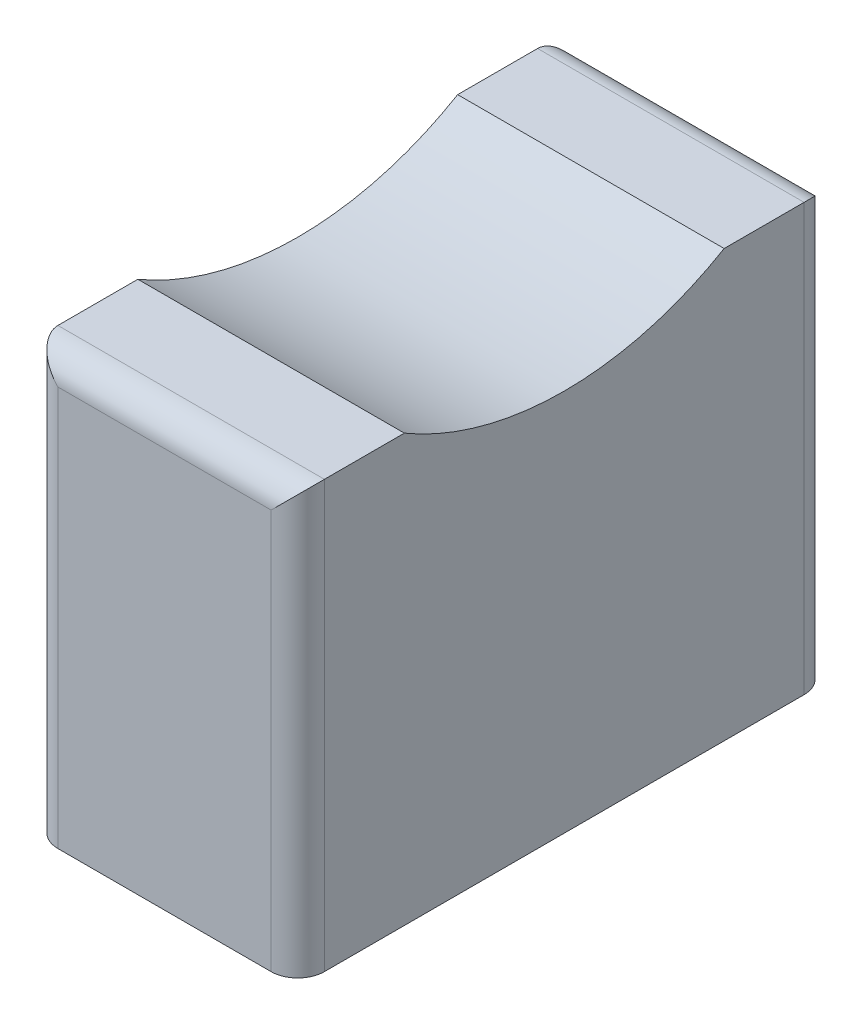
ISO-10303-21;
HEADER;
FILE_DESCRIPTION(('STEP AP214'),'2;1');
FILE_NAME('part.step','',(''),(''),'','','');
FILE_SCHEMA(('AUTOMOTIVE_DESIGN { 1 0 10303 214 1 1 1 1 }'));
ENDSEC;
DATA;
#1=APPLICATION_CONTEXT('core data for automotive mechanical design processes');
#2=APPLICATION_PROTOCOL_DEFINITION('international standard','automotive_design',2000,#1);
#3=PRODUCT_CONTEXT('',#1,'mechanical');
#4=PRODUCT('Part','Part','',(#3));
#5=PRODUCT_RELATED_PRODUCT_CATEGORY('part','',(#4));
#6=PRODUCT_DEFINITION_FORMATION('','',#4);
#7=PRODUCT_DEFINITION_CONTEXT('part definition',#1,'design');
#8=PRODUCT_DEFINITION('design','',#6,#7);
#9=PRODUCT_DEFINITION_SHAPE('','',#8);
#10=(LENGTH_UNIT() NAMED_UNIT(*) SI_UNIT(.MILLI.,.METRE.));
#11=(NAMED_UNIT(*) PLANE_ANGLE_UNIT() SI_UNIT($,.RADIAN.));
#12=(NAMED_UNIT(*) SI_UNIT($,.STERADIAN.) SOLID_ANGLE_UNIT());
#13=UNCERTAINTY_MEASURE_WITH_UNIT(LENGTH_MEASURE(1.E-05),#10,'distance_accuracy_value','');
#14=(GEOMETRIC_REPRESENTATION_CONTEXT(3) GLOBAL_UNCERTAINTY_ASSIGNED_CONTEXT((#13)) GLOBAL_UNIT_ASSIGNED_CONTEXT((#10,
#11,#12)) REPRESENTATION_CONTEXT('',''));
#15=CARTESIAN_POINT('',(0.,0.,0.));
#16=DIRECTION('',(0.,0.,1.));
#17=DIRECTION('',(1.,0.,0.));
#18=AXIS2_PLACEMENT_3D('',#15,#16,#17);
#19=CARTESIAN_POINT('',(0.,16.,0.));
#20=DIRECTION('',(0.,-1.,0.));
#21=DIRECTION('',(0.,0.,-1.));
#22=AXIS2_PLACEMENT_3D('',#19,#20,#21);
#23=PLANE('',#22);
#24=DIRECTION('',(0.,0.,-1.));
#25=VECTOR('',#24,1.);
#26=CARTESIAN_POINT('',(5.,16.,10.));
#27=LINE('',#26,#25);
#28=CARTESIAN_POINT('',(5.,16.,-6.));
#29=VERTEX_POINT('',#28);
#30=CARTESIAN_POINT('',(5.,16.,-9.));
#31=VERTEX_POINT('',#30);
#32=EDGE_CURVE('E224',#29,#31,#27,.T.);
#33=ORIENTED_EDGE('',*,*,#32,.T.);
#34=DIRECTION('',(-1.,0.,0.));
#35=VECTOR('',#34,1.);
#36=CARTESIAN_POINT('',(0.,16.,-9.));
#37=LINE('',#36,#35);
#38=CARTESIAN_POINT('',(-5.,16.,-9.));
#39=VERTEX_POINT('',#38);
#40=EDGE_CURVE('E150',#31,#39,#37,.T.);
#41=ORIENTED_EDGE('',*,*,#40,.T.);
#42=DIRECTION('',(0.,0.,1.));
#43=VECTOR('',#42,1.);
#44=CARTESIAN_POINT('',(-5.,16.,10.));
#45=LINE('',#44,#43);
#46=CARTESIAN_POINT('',(-5.,16.,-6.));
#47=VERTEX_POINT('',#46);
#48=EDGE_CURVE('E144',#39,#47,#45,.T.);
#49=ORIENTED_EDGE('',*,*,#48,.T.);
#50=DIRECTION('',(1.,0.,0.));
#51=VECTOR('',#50,1.);
#52=CARTESIAN_POINT('',(-5.,16.,-6.));
#53=LINE('',#52,#51);
#54=EDGE_CURVE('E147',#47,#29,#53,.T.);
#55=ORIENTED_EDGE('',*,*,#54,.T.);
#56=EDGE_LOOP('',(#33,#41,#49,#55));
#57=FACE_BOUND('',#56,.T.);
#58=ADVANCED_FACE('F39',(#57),#23,.F.);
#59=CARTESIAN_POINT('',(5.,16.,10.));
#60=DIRECTION('',(-1.,0.,0.));
#61=DIRECTION('',(0.,0.,1.));
#62=AXIS2_PLACEMENT_3D('',#59,#60,#61);
#63=PLANE('',#62);
#64=DIRECTION('',(0.,0.,-1.));
#65=VECTOR('',#64,1.);
#66=CARTESIAN_POINT('',(5.,0.,10.));
#67=LINE('',#66,#65);
#68=CARTESIAN_POINT('',(5.,0.,9.));
#69=VERTEX_POINT('',#68);
#70=CARTESIAN_POINT('',(5.,0.,-9.));
#71=VERTEX_POINT('',#70);
#72=EDGE_CURVE('E212',#69,#71,#67,.T.);
#73=ORIENTED_EDGE('',*,*,#72,.T.);
#74=DIRECTION('',(0.,-1.,0.));
#75=VECTOR('',#74,1.);
#76=CARTESIAN_POINT('',(5.,16.,-9.));
#77=LINE('',#76,#75);
#78=EDGE_CURVE('E272',#71,#31,#77,.F.);
#79=ORIENTED_EDGE('',*,*,#78,.T.);
#80=ORIENTED_EDGE('',*,*,#32,.F.);
#81=CARTESIAN_POINT('',(5.,26.1987787005097,0.));
#82=DIRECTION('',(1.,0.,0.));
#83=DIRECTION('',(0.,0.,-1.));
#84=AXIS2_PLACEMENT_3D('',#81,#82,#83);
#85=CIRCLE('',#84,11.8327970903743);
#86=CARTESIAN_POINT('',(5.,16.,6.));
#87=VERTEX_POINT('',#86);
#88=EDGE_CURVE('E162',#87,#29,#85,.T.);
#89=ORIENTED_EDGE('',*,*,#88,.F.);
#90=CARTESIAN_POINT('',(5.,16.,9.));
#91=VERTEX_POINT('',#90);
#92=EDGE_CURVE('E222',#91,#87,#27,.T.);
#93=ORIENTED_EDGE('',*,*,#92,.F.);
#94=DIRECTION('',(0.,-1.,0.));
#95=VECTOR('',#94,1.);
#96=CARTESIAN_POINT('',(5.,16.,9.));
#97=LINE('',#96,#95);
#98=EDGE_CURVE('E269',#91,#69,#97,.T.);
#99=ORIENTED_EDGE('',*,*,#98,.T.);
#100=EDGE_LOOP('',(#73,#79,#80,#89,#93,#99));
#101=FACE_BOUND('',#100,.T.);
#102=ADVANCED_FACE('F303',(#101),#63,.F.);
#103=CARTESIAN_POINT('',(-5.,16.,-10.));
#104=DIRECTION('',(0.,0.,1.));
#105=DIRECTION('',(1.,0.,0.));
#106=AXIS2_PLACEMENT_3D('',#103,#104,#105);
#107=PLANE('',#106);
#108=DIRECTION('',(-1.,0.,0.));
#109=VECTOR('',#108,1.);
#110=CARTESIAN_POINT('',(-5.,0.,-10.));
#111=LINE('',#110,#109);
#112=CARTESIAN_POINT('',(4.,0.,-10.));
#113=VERTEX_POINT('',#112);
#114=CARTESIAN_POINT('',(-4.,0.,-10.));
#115=VERTEX_POINT('',#114);
#116=EDGE_CURVE('E229',#113,#115,#111,.T.);
#117=ORIENTED_EDGE('',*,*,#116,.T.);
#118=DIRECTION('',(0.,-1.,0.));
#119=VECTOR('',#118,1.);
#120=CARTESIAN_POINT('',(-4.,16.,-10.));
#121=LINE('',#120,#119);
#122=CARTESIAN_POINT('',(-4.,15.,-10.));
#123=VERTEX_POINT('',#122);
#124=EDGE_CURVE('E248',#115,#123,#121,.F.);
#125=ORIENTED_EDGE('',*,*,#124,.T.);
#126=DIRECTION('',(-1.,0.,0.));
#127=VECTOR('',#126,1.);
#128=CARTESIAN_POINT('',(-5.,15.,-10.));
#129=LINE('',#128,#127);
#130=CARTESIAN_POINT('',(4.,15.,-10.));
#131=VERTEX_POINT('',#130);
#132=EDGE_CURVE('E245',#123,#131,#129,.F.);
#133=ORIENTED_EDGE('',*,*,#132,.T.);
#134=DIRECTION('',(0.,-1.,0.));
#135=VECTOR('',#134,1.);
#136=CARTESIAN_POINT('',(4.,16.,-10.));
#137=LINE('',#136,#135);
#138=EDGE_CURVE('E242',#131,#113,#137,.T.);
#139=ORIENTED_EDGE('',*,*,#138,.T.);
#140=EDGE_LOOP('',(#117,#125,#133,#139));
#141=FACE_BOUND('',#140,.T.);
#142=ADVANCED_FACE('F335',(#141),#107,.F.);
#143=CARTESIAN_POINT('',(-5.,16.,10.));
#144=DIRECTION('',(1.,0.,0.));
#145=DIRECTION('',(0.,0.,-1.));
#146=AXIS2_PLACEMENT_3D('',#143,#144,#145);
#147=PLANE('',#146);
#148=ORIENTED_EDGE('',*,*,#48,.F.);
#149=DIRECTION('',(0.,-1.,0.));
#150=VECTOR('',#149,1.);
#151=CARTESIAN_POINT('',(-5.,16.,-9.));
#152=LINE('',#151,#150);
#153=CARTESIAN_POINT('',(-5.,0.,-9.));
#154=VERTEX_POINT('',#153);
#155=EDGE_CURVE('E254',#39,#154,#152,.T.);
#156=ORIENTED_EDGE('',*,*,#155,.T.);
#157=DIRECTION('',(0.,0.,1.));
#158=VECTOR('',#157,1.);
#159=CARTESIAN_POINT('',(-5.,0.,10.));
#160=LINE('',#159,#158);
#161=CARTESIAN_POINT('',(-5.,0.,9.));
#162=VERTEX_POINT('',#161);
#163=EDGE_CURVE('E233',#154,#162,#160,.T.);
#164=ORIENTED_EDGE('',*,*,#163,.T.);
#165=DIRECTION('',(0.,-1.,0.));
#166=VECTOR('',#165,1.);
#167=CARTESIAN_POINT('',(-5.,16.,9.));
#168=LINE('',#167,#166);
#169=CARTESIAN_POINT('',(-5.,16.,9.));
#170=VERTEX_POINT('',#169);
#171=EDGE_CURVE('E251',#162,#170,#168,.F.);
#172=ORIENTED_EDGE('',*,*,#171,.T.);
#173=CARTESIAN_POINT('',(-5.,16.,6.));
#174=VERTEX_POINT('',#173);
#175=EDGE_CURVE('E154',#174,#170,#45,.T.);
#176=ORIENTED_EDGE('',*,*,#175,.F.);
#177=CARTESIAN_POINT('',(-5.,26.1987787005097,0.));
#178=DIRECTION('',(1.,0.,0.));
#179=DIRECTION('',(0.,0.,-1.));
#180=AXIS2_PLACEMENT_3D('',#177,#178,#179);
#181=CIRCLE('',#180,11.8327970903743);
#182=EDGE_CURVE('E159',#174,#47,#181,.T.);
#183=ORIENTED_EDGE('',*,*,#182,.T.);
#184=EDGE_LOOP('',(#148,#156,#164,#172,#176,#183));
#185=FACE_BOUND('',#184,.T.);
#186=ADVANCED_FACE('F167',(#185),#147,.F.);
#187=CARTESIAN_POINT('',(-5.,16.,10.));
#188=DIRECTION('',(0.,0.,-1.));
#189=DIRECTION('',(-1.,0.,0.));
#190=AXIS2_PLACEMENT_3D('',#187,#188,#189);
#191=PLANE('',#190);
#192=DIRECTION('',(1.,0.,0.));
#193=VECTOR('',#192,1.);
#194=CARTESIAN_POINT('',(-5.,15.,10.));
#195=LINE('',#194,#193);
#196=CARTESIAN_POINT('',(4.,15.,10.));
#197=VERTEX_POINT('',#196);
#198=CARTESIAN_POINT('',(-4.,15.,10.));
#199=VERTEX_POINT('',#198);
#200=EDGE_CURVE('E57',#197,#199,#195,.F.);
#201=ORIENTED_EDGE('',*,*,#200,.T.);
#202=DIRECTION('',(0.,-1.,0.));
#203=VECTOR('',#202,1.);
#204=CARTESIAN_POINT('',(-4.,16.,10.));
#205=LINE('',#204,#203);
#206=CARTESIAN_POINT('',(-4.,0.,10.));
#207=VERTEX_POINT('',#206);
#208=EDGE_CURVE('E49',#199,#207,#205,.T.);
#209=ORIENTED_EDGE('',*,*,#208,.T.);
#210=DIRECTION('',(1.,0.,0.));
#211=VECTOR('',#210,1.);
#212=CARTESIAN_POINT('',(-5.,0.,10.));
#213=LINE('',#212,#211);
#214=CARTESIAN_POINT('',(4.,0.,10.));
#215=VERTEX_POINT('',#214);
#216=EDGE_CURVE('E237',#207,#215,#213,.T.);
#217=ORIENTED_EDGE('',*,*,#216,.T.);
#218=DIRECTION('',(0.,-1.,0.));
#219=VECTOR('',#218,1.);
#220=CARTESIAN_POINT('',(4.,16.,10.));
#221=LINE('',#220,#219);
#222=EDGE_CURVE('E62',#215,#197,#221,.F.);
#223=ORIENTED_EDGE('',*,*,#222,.T.);
#224=EDGE_LOOP('',(#201,#209,#217,#223));
#225=FACE_BOUND('',#224,.T.);
#226=ADVANCED_FACE('F320',(#225),#191,.F.);
#227=ORIENTED_EDGE('',*,*,#175,.T.);
#228=DIRECTION('',(1.,0.,0.));
#229=VECTOR('',#228,1.);
#230=CARTESIAN_POINT('',(0.,16.,9.));
#231=LINE('',#230,#229);
#232=EDGE_CURVE('E11',#170,#91,#231,.T.);
#233=ORIENTED_EDGE('',*,*,#232,.T.);
#234=ORIENTED_EDGE('',*,*,#92,.T.);
#235=DIRECTION('',(1.,0.,0.));
#236=VECTOR('',#235,1.);
#237=CARTESIAN_POINT('',(-5.,16.,6.));
#238=LINE('',#237,#236);
#239=EDGE_CURVE('E164',#174,#87,#238,.T.);
#240=ORIENTED_EDGE('',*,*,#239,.F.);
#241=EDGE_LOOP('',(#227,#233,#234,#240));
#242=FACE_BOUND('',#241,.T.);
#243=ADVANCED_FACE('F318',(#242),#23,.F.);
#244=CARTESIAN_POINT('',(0.,0.,0.));
#245=DIRECTION('',(0.,-1.,0.));
#246=DIRECTION('',(0.,0.,-1.));
#247=AXIS2_PLACEMENT_3D('',#244,#245,#246);
#248=PLANE('',#247);
#249=DIRECTION('',(0.,0.,1.));
#250=VECTOR('',#249,1.);
#251=CARTESIAN_POINT('',(0.7,0.,2.15));
#252=LINE('',#251,#250);
#253=CARTESIAN_POINT('',(0.7,0.,-2.15));
#254=VERTEX_POINT('',#253);
#255=CARTESIAN_POINT('',(0.7,0.,2.15));
#256=VERTEX_POINT('',#255);
#257=EDGE_CURVE('E176',#254,#256,#252,.T.);
#258=ORIENTED_EDGE('',*,*,#257,.F.);
#259=DIRECTION('',(1.,0.,0.));
#260=VECTOR('',#259,1.);
#261=CARTESIAN_POINT('',(-0.7,0.,-2.15));
#262=LINE('',#261,#260);
#263=CARTESIAN_POINT('',(-0.7,0.,-2.15));
#264=VERTEX_POINT('',#263);
#265=EDGE_CURVE('E183',#264,#254,#262,.T.);
#266=ORIENTED_EDGE('',*,*,#265,.F.);
#267=DIRECTION('',(0.,0.,-1.));
#268=VECTOR('',#267,1.);
#269=CARTESIAN_POINT('',(-0.7,0.,2.15));
#270=LINE('',#269,#268);
#271=CARTESIAN_POINT('',(-0.7,0.,2.15));
#272=VERTEX_POINT('',#271);
#273=EDGE_CURVE('E202',#272,#264,#270,.T.);
#274=ORIENTED_EDGE('',*,*,#273,.F.);
#275=DIRECTION('',(-1.,0.,0.));
#276=VECTOR('',#275,1.);
#277=CARTESIAN_POINT('',(-0.7,0.,2.15));
#278=LINE('',#277,#276);
#279=EDGE_CURVE('E198',#256,#272,#278,.T.);
#280=ORIENTED_EDGE('',*,*,#279,.F.);
#281=EDGE_LOOP('',(#258,#266,#274,#280));
#282=FACE_BOUND('',#281,.T.);
#283=ORIENTED_EDGE('',*,*,#163,.F.);
#284=CARTESIAN_POINT('',(-4.,0.,-9.));
#285=DIRECTION('',(0.,-1.,0.));
#286=DIRECTION('',(0.,0.,-1.));
#287=AXIS2_PLACEMENT_3D('',#284,#285,#286);
#288=CIRCLE('',#287,1.);
#289=EDGE_CURVE('E266',#154,#115,#288,.T.);
#290=ORIENTED_EDGE('',*,*,#289,.T.);
#291=ORIENTED_EDGE('',*,*,#116,.F.);
#292=CARTESIAN_POINT('',(4.,0.,-9.));
#293=DIRECTION('',(0.,-1.,0.));
#294=DIRECTION('',(0.,0.,-1.));
#295=AXIS2_PLACEMENT_3D('',#292,#293,#294);
#296=CIRCLE('',#295,1.);
#297=EDGE_CURVE('E263',#113,#71,#296,.T.);
#298=ORIENTED_EDGE('',*,*,#297,.T.);
#299=ORIENTED_EDGE('',*,*,#72,.F.);
#300=CARTESIAN_POINT('',(4.,0.,9.));
#301=DIRECTION('',(0.,-1.,0.));
#302=DIRECTION('',(0.,0.,-1.));
#303=AXIS2_PLACEMENT_3D('',#300,#301,#302);
#304=CIRCLE('',#303,1.);
#305=EDGE_CURVE('E257',#69,#215,#304,.T.);
#306=ORIENTED_EDGE('',*,*,#305,.T.);
#307=ORIENTED_EDGE('',*,*,#216,.F.);
#308=CARTESIAN_POINT('',(-4.,0.,9.));
#309=DIRECTION('',(0.,-1.,0.));
#310=DIRECTION('',(0.,0.,-1.));
#311=AXIS2_PLACEMENT_3D('',#308,#309,#310);
#312=CIRCLE('',#311,1.);
#313=EDGE_CURVE('E260',#207,#162,#312,.T.);
#314=ORIENTED_EDGE('',*,*,#313,.T.);
#315=EDGE_LOOP('',(#283,#290,#291,#298,#299,#306,#307,#314));
#316=FACE_BOUND('',#315,.T.);
#317=ADVANCED_FACE('F307',(#282,#316),#248,.T.);
#318=CARTESIAN_POINT('',(0.7,5.,2.15));
#319=DIRECTION('',(1.,0.,0.));
#320=DIRECTION('',(0.,0.,-1.));
#321=AXIS2_PLACEMENT_3D('',#318,#319,#320);
#322=PLANE('',#321);
#323=ORIENTED_EDGE('',*,*,#257,.T.);
#324=DIRECTION('',(0.,-1.,0.));
#325=VECTOR('',#324,1.);
#326=CARTESIAN_POINT('',(0.7,5.,2.15));
#327=LINE('',#326,#325);
#328=CARTESIAN_POINT('',(0.7,5.,2.15));
#329=VERTEX_POINT('',#328);
#330=EDGE_CURVE('E195',#329,#256,#327,.T.);
#331=ORIENTED_EDGE('',*,*,#330,.F.);
#332=DIRECTION('',(0.,0.,1.));
#333=VECTOR('',#332,1.);
#334=CARTESIAN_POINT('',(0.7,5.,2.15));
#335=LINE('',#334,#333);
#336=CARTESIAN_POINT('',(0.7,5.,-2.15));
#337=VERTEX_POINT('',#336);
#338=EDGE_CURVE('E178',#337,#329,#335,.T.);
#339=ORIENTED_EDGE('',*,*,#338,.F.);
#340=DIRECTION('',(0.,-1.,0.));
#341=VECTOR('',#340,1.);
#342=CARTESIAN_POINT('',(0.7,5.,-2.15));
#343=LINE('',#342,#341);
#344=EDGE_CURVE('E209',#337,#254,#343,.T.);
#345=ORIENTED_EDGE('',*,*,#344,.T.);
#346=EDGE_LOOP('',(#323,#331,#339,#345));
#347=FACE_BOUND('',#346,.T.);
#348=ADVANCED_FACE('F326',(#347),#322,.F.);
#349=CARTESIAN_POINT('',(-0.7,5.,-2.15));
#350=DIRECTION('',(0.,0.,-1.));
#351=DIRECTION('',(-1.,0.,0.));
#352=AXIS2_PLACEMENT_3D('',#349,#350,#351);
#353=PLANE('',#352);
#354=ORIENTED_EDGE('',*,*,#265,.T.);
#355=ORIENTED_EDGE('',*,*,#344,.F.);
#356=DIRECTION('',(1.,0.,0.));
#357=VECTOR('',#356,1.);
#358=CARTESIAN_POINT('',(-0.7,5.,-2.15));
#359=LINE('',#358,#357);
#360=CARTESIAN_POINT('',(-0.7,5.,-2.15));
#361=VERTEX_POINT('',#360);
#362=EDGE_CURVE('E191',#361,#337,#359,.T.);
#363=ORIENTED_EDGE('',*,*,#362,.F.);
#364=DIRECTION('',(0.,-1.,0.));
#365=VECTOR('',#364,1.);
#366=CARTESIAN_POINT('',(-0.7,5.,-2.15));
#367=LINE('',#366,#365);
#368=EDGE_CURVE('E213',#361,#264,#367,.T.);
#369=ORIENTED_EDGE('',*,*,#368,.T.);
#370=EDGE_LOOP('',(#354,#355,#363,#369));
#371=FACE_BOUND('',#370,.T.);
#372=ADVANCED_FACE('F404',(#371),#353,.F.);
#373=CARTESIAN_POINT('',(-0.7,5.,2.15));
#374=DIRECTION('',(-1.,0.,0.));
#375=DIRECTION('',(0.,0.,1.));
#376=AXIS2_PLACEMENT_3D('',#373,#374,#375);
#377=PLANE('',#376);
#378=ORIENTED_EDGE('',*,*,#273,.T.);
#379=ORIENTED_EDGE('',*,*,#368,.F.);
#380=DIRECTION('',(0.,0.,-1.));
#381=VECTOR('',#380,1.);
#382=CARTESIAN_POINT('',(-0.7,5.,2.15));
#383=LINE('',#382,#381);
#384=CARTESIAN_POINT('',(-0.7,5.,2.15));
#385=VERTEX_POINT('',#384);
#386=EDGE_CURVE('E187',#385,#361,#383,.T.);
#387=ORIENTED_EDGE('',*,*,#386,.F.);
#388=DIRECTION('',(0.,-1.,0.));
#389=VECTOR('',#388,1.);
#390=CARTESIAN_POINT('',(-0.7,5.,2.15));
#391=LINE('',#390,#389);
#392=EDGE_CURVE('E216',#385,#272,#391,.T.);
#393=ORIENTED_EDGE('',*,*,#392,.T.);
#394=EDGE_LOOP('',(#378,#379,#387,#393));
#395=FACE_BOUND('',#394,.T.);
#396=ADVANCED_FACE('F396',(#395),#377,.F.);
#397=CARTESIAN_POINT('',(-0.7,5.,2.15));
#398=DIRECTION('',(0.,0.,1.));
#399=DIRECTION('',(1.,0.,0.));
#400=AXIS2_PLACEMENT_3D('',#397,#398,#399);
#401=PLANE('',#400);
#402=ORIENTED_EDGE('',*,*,#279,.T.);
#403=ORIENTED_EDGE('',*,*,#392,.F.);
#404=DIRECTION('',(-1.,0.,0.));
#405=VECTOR('',#404,1.);
#406=CARTESIAN_POINT('',(-0.7,5.,2.15));
#407=LINE('',#406,#405);
#408=EDGE_CURVE('E182',#329,#385,#407,.T.);
#409=ORIENTED_EDGE('',*,*,#408,.F.);
#410=ORIENTED_EDGE('',*,*,#330,.T.);
#411=EDGE_LOOP('',(#402,#403,#409,#410));
#412=FACE_BOUND('',#411,.T.);
#413=ADVANCED_FACE('F388',(#412),#401,.F.);
#414=CARTESIAN_POINT('',(0.,5.,0.));
#415=DIRECTION('',(0.,-1.,0.));
#416=DIRECTION('',(0.,0.,-1.));
#417=AXIS2_PLACEMENT_3D('',#414,#415,#416);
#418=PLANE('',#417);
#419=ORIENTED_EDGE('',*,*,#338,.T.);
#420=ORIENTED_EDGE('',*,*,#408,.T.);
#421=ORIENTED_EDGE('',*,*,#386,.T.);
#422=ORIENTED_EDGE('',*,*,#362,.T.);
#423=EDGE_LOOP('',(#419,#420,#421,#422));
#424=FACE_BOUND('',#423,.T.);
#425=ADVANCED_FACE('F381',(#424),#418,.T.);
#426=CARTESIAN_POINT('',(-5.,26.1987787005097,0.));
#427=DIRECTION('',(1.,0.,0.));
#428=DIRECTION('',(0.,0.,-1.));
#429=AXIS2_PLACEMENT_3D('',#426,#427,#428);
#430=CYLINDRICAL_SURFACE('',#429,11.8327970903743);
#431=ORIENTED_EDGE('',*,*,#88,.T.);
#432=ORIENTED_EDGE('',*,*,#54,.F.);
#433=ORIENTED_EDGE('',*,*,#182,.F.);
#434=ORIENTED_EDGE('',*,*,#239,.T.);
#435=EDGE_LOOP('',(#431,#432,#433,#434));
#436=FACE_BOUND('',#435,.T.);
#437=ADVANCED_FACE('F157',(#436),#430,.F.);
#438=CARTESIAN_POINT('',(4.,16.,-9.));
#439=DIRECTION('',(0.,-1.,0.));
#440=DIRECTION('',(0.,0.,-1.));
#441=AXIS2_PLACEMENT_3D('',#438,#439,#440);
#442=CYLINDRICAL_SURFACE('',#441,1.);
#443=ORIENTED_EDGE('',*,*,#297,.F.);
#444=ORIENTED_EDGE('',*,*,#138,.F.);
#445=CARTESIAN_POINT('',(4.,15.,-9.));
#446=DIRECTION('',(0.707106781186547,-0.707106781186547,0.));
#447=DIRECTION('',(-0.707106781186547,-0.707106781186547,0.));
#448=AXIS2_PLACEMENT_3D('',#445,#446,#447);
#449=ELLIPSE('',#448,1.41421356237309,1.);
#450=EDGE_CURVE('E172',#31,#131,#449,.F.);
#451=ORIENTED_EDGE('',*,*,#450,.F.);
#452=ORIENTED_EDGE('',*,*,#78,.F.);
#453=EDGE_LOOP('',(#443,#444,#451,#452));
#454=FACE_BOUND('',#453,.T.);
#455=ADVANCED_FACE('F313',(#454),#442,.T.);
#456=CARTESIAN_POINT('',(-4.,16.,-9.));
#457=DIRECTION('',(0.,-1.,0.));
#458=DIRECTION('',(0.,0.,-1.));
#459=AXIS2_PLACEMENT_3D('',#456,#457,#458);
#460=CYLINDRICAL_SURFACE('',#459,1.);
#461=ORIENTED_EDGE('',*,*,#289,.F.);
#462=ORIENTED_EDGE('',*,*,#155,.F.);
#463=CARTESIAN_POINT('',(-4.,15.,-9.));
#464=DIRECTION('',(-0.707106781186547,-0.707106781186547,0.));
#465=DIRECTION('',(0.707106781186547,-0.707106781186547,0.));
#466=AXIS2_PLACEMENT_3D('',#463,#464,#465);
#467=ELLIPSE('',#466,1.41421356237309,1.);
#468=EDGE_CURVE('E281',#123,#39,#467,.F.);
#469=ORIENTED_EDGE('',*,*,#468,.F.);
#470=ORIENTED_EDGE('',*,*,#124,.F.);
#471=EDGE_LOOP('',(#461,#462,#469,#470));
#472=FACE_BOUND('',#471,.T.);
#473=ADVANCED_FACE('F347',(#472),#460,.T.);
#474=CARTESIAN_POINT('',(0.,15.,-9.));
#475=DIRECTION('',(-1.,0.,0.));
#476=DIRECTION('',(0.,0.,1.));
#477=AXIS2_PLACEMENT_3D('',#474,#475,#476);
#478=CYLINDRICAL_SURFACE('',#477,1.);
#479=ORIENTED_EDGE('',*,*,#450,.T.);
#480=ORIENTED_EDGE('',*,*,#132,.F.);
#481=ORIENTED_EDGE('',*,*,#468,.T.);
#482=ORIENTED_EDGE('',*,*,#40,.F.);
#483=EDGE_LOOP('',(#479,#480,#481,#482));
#484=FACE_BOUND('',#483,.T.);
#485=ADVANCED_FACE('F344',(#484),#478,.T.);
#486=CARTESIAN_POINT('',(4.,16.,9.));
#487=DIRECTION('',(0.,-1.,0.));
#488=DIRECTION('',(0.,0.,-1.));
#489=AXIS2_PLACEMENT_3D('',#486,#487,#488);
#490=CYLINDRICAL_SURFACE('',#489,1.);
#491=ORIENTED_EDGE('',*,*,#305,.F.);
#492=ORIENTED_EDGE('',*,*,#98,.F.);
#493=CARTESIAN_POINT('',(4.,15.,9.));
#494=DIRECTION('',(0.707106781186547,-0.707106781186547,0.));
#495=DIRECTION('',(0.707106781186547,0.707106781186547,0.));
#496=AXIS2_PLACEMENT_3D('',#493,#494,#495);
#497=ELLIPSE('',#496,1.41421356237309,1.);
#498=EDGE_CURVE('E43',#197,#91,#497,.F.);
#499=ORIENTED_EDGE('',*,*,#498,.F.);
#500=ORIENTED_EDGE('',*,*,#222,.F.);
#501=EDGE_LOOP('',(#491,#492,#499,#500));
#502=FACE_BOUND('',#501,.T.);
#503=ADVANCED_FACE('F41',(#502),#490,.T.);
#504=CARTESIAN_POINT('',(0.,15.,9.));
#505=DIRECTION('',(1.,0.,0.));
#506=DIRECTION('',(0.,0.,-1.));
#507=AXIS2_PLACEMENT_3D('',#504,#505,#506);
#508=CYLINDRICAL_SURFACE('',#507,1.);
#509=ORIENTED_EDGE('',*,*,#498,.T.);
#510=ORIENTED_EDGE('',*,*,#232,.F.);
#511=CARTESIAN_POINT('',(-4.,15.,9.));
#512=DIRECTION('',(0.707106781186547,0.707106781186547,0.));
#513=DIRECTION('',(0.707106781186547,-0.707106781186547,0.));
#514=AXIS2_PLACEMENT_3D('',#511,#512,#513);
#515=ELLIPSE('',#514,1.41421356237309,1.);
#516=EDGE_CURVE('E286',#199,#170,#515,.F.);
#517=ORIENTED_EDGE('',*,*,#516,.F.);
#518=ORIENTED_EDGE('',*,*,#200,.F.);
#519=EDGE_LOOP('',(#509,#510,#517,#518));
#520=FACE_BOUND('',#519,.T.);
#521=ADVANCED_FACE('F296',(#520),#508,.T.);
#522=CARTESIAN_POINT('',(-4.,16.,9.));
#523=DIRECTION('',(0.,-1.,0.));
#524=DIRECTION('',(0.,0.,-1.));
#525=AXIS2_PLACEMENT_3D('',#522,#523,#524);
#526=CYLINDRICAL_SURFACE('',#525,1.);
#527=ORIENTED_EDGE('',*,*,#516,.T.);
#528=ORIENTED_EDGE('',*,*,#171,.F.);
#529=ORIENTED_EDGE('',*,*,#313,.F.);
#530=ORIENTED_EDGE('',*,*,#208,.F.);
#531=EDGE_LOOP('',(#527,#528,#529,#530));
#532=FACE_BOUND('',#531,.T.);
#533=ADVANCED_FACE('F354',(#532),#526,.T.);
#534=CLOSED_SHELL('',(#58,#102,#142,#186,#226,#243,#317,#348,#372,#396,#413,#425,#437,#455,#473,
#485,#503,#521,#533));
#535=MANIFOLD_SOLID_BREP('B2',#534);
#536=ADVANCED_BREP_SHAPE_REPRESENTATION('',(#18,#535),#14);
#537=SHAPE_DEFINITION_REPRESENTATION(#9,#536);
ENDSEC;
END-ISO-10303-21;
